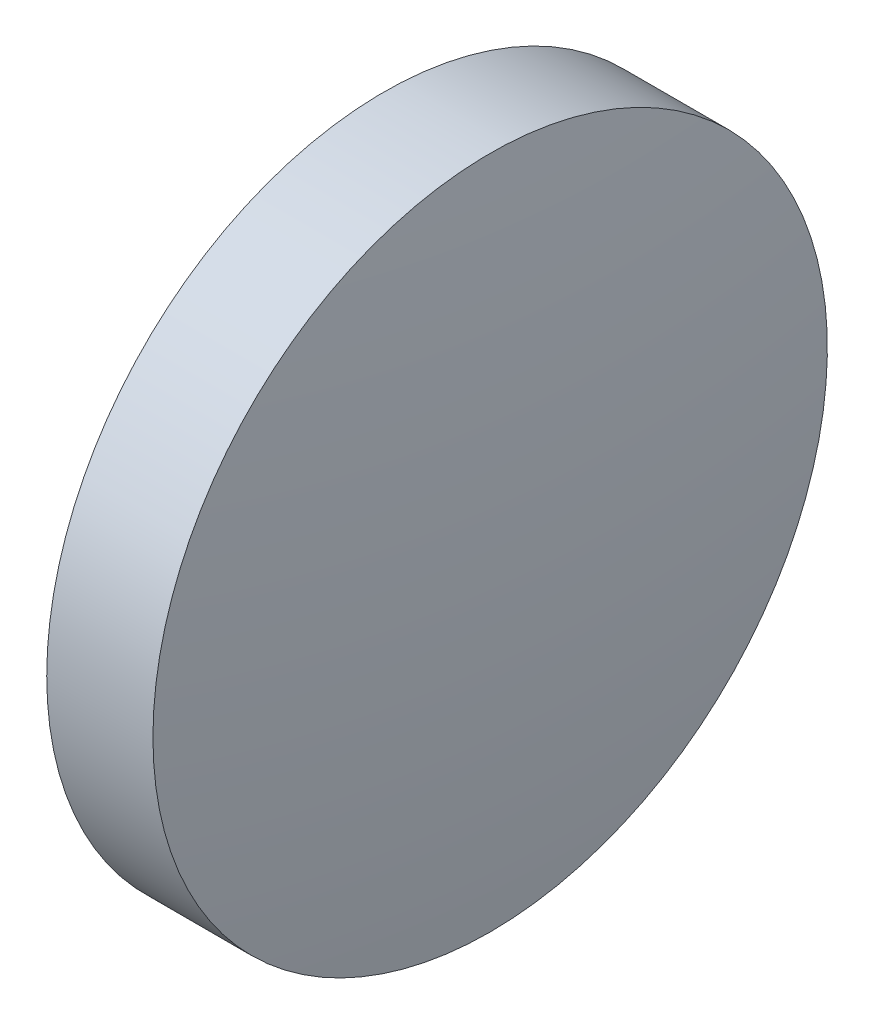
ISO-10303-21;
HEADER;
FILE_DESCRIPTION(('STEP AP214'),'2;1');
FILE_NAME('part.step','',(''),(''),'','','');
FILE_SCHEMA(('AUTOMOTIVE_DESIGN { 1 0 10303 214 1 1 1 1 }'));
ENDSEC;
DATA;
#1=APPLICATION_CONTEXT('core data for automotive mechanical design processes');
#2=APPLICATION_PROTOCOL_DEFINITION('international standard','automotive_design',2000,#1);
#3=PRODUCT_CONTEXT('',#1,'mechanical');
#4=PRODUCT('Part','Part','',(#3));
#5=PRODUCT_RELATED_PRODUCT_CATEGORY('part','',(#4));
#6=PRODUCT_DEFINITION_FORMATION('','',#4);
#7=PRODUCT_DEFINITION_CONTEXT('part definition',#1,'design');
#8=PRODUCT_DEFINITION('design','',#6,#7);
#9=PRODUCT_DEFINITION_SHAPE('','',#8);
#10=(LENGTH_UNIT() NAMED_UNIT(*) SI_UNIT(.MILLI.,.METRE.));
#11=(NAMED_UNIT(*) PLANE_ANGLE_UNIT() SI_UNIT($,.RADIAN.));
#12=(NAMED_UNIT(*) SI_UNIT($,.STERADIAN.) SOLID_ANGLE_UNIT());
#13=UNCERTAINTY_MEASURE_WITH_UNIT(LENGTH_MEASURE(1.E-05),#10,'distance_accuracy_value','');
#14=(GEOMETRIC_REPRESENTATION_CONTEXT(3) GLOBAL_UNCERTAINTY_ASSIGNED_CONTEXT((#13)) GLOBAL_UNIT_ASSIGNED_CONTEXT((#10,
#11,#12)) REPRESENTATION_CONTEXT('',''));
#15=CARTESIAN_POINT('',(0.,0.,0.));
#16=DIRECTION('',(0.,0.,1.));
#17=DIRECTION('',(1.,0.,0.));
#18=AXIS2_PLACEMENT_3D('',#15,#16,#17);
#19=CARTESIAN_POINT('',(503.609445364495,54.8274799908201,0.));
#20=DIRECTION('',(-1.,0.,0.));
#21=DIRECTION('',(0.,-1.,0.));
#22=AXIS2_PLACEMENT_3D('',#19,#20,#21);
#23=SPHERICAL_SURFACE('',#22,50.6031249999999);
#24=CARTESIAN_POINT('',(553.812570364495,54.82747999082,0.));
#25=DIRECTION('',(-1.,0.,0.));
#26=DIRECTION('',(0.,0.,1.));
#27=AXIS2_PLACEMENT_3D('',#24,#25,#26);
#28=CIRCLE('',#27,6.35);
#29=CARTESIAN_POINT('',(553.812570364495,54.82747999082,6.35));
#30=VERTEX_POINT('',#29);
#31=EDGE_CURVE('E10',#30,#30,#28,.T.);
#32=ORIENTED_EDGE('',*,*,#31,.F.);
#33=EDGE_LOOP('',(#32));
#34=FACE_BOUND('',#33,.T.);
#35=ADVANCED_FACE('F35',(#34),#23,.T.);
#36=CARTESIAN_POINT('',(549.55203921864,54.82747999082,0.));
#37=DIRECTION('',(-1.,0.,0.));
#38=DIRECTION('',(0.,0.,1.));
#39=AXIS2_PLACEMENT_3D('',#36,#37,#38);
#40=CYLINDRICAL_SURFACE('',#39,6.35);
#41=CARTESIAN_POINT('',(551.812570364495,54.82747999082,0.));
#42=DIRECTION('',(-1.,0.,0.));
#43=DIRECTION('',(0.,0.,1.));
#44=AXIS2_PLACEMENT_3D('',#41,#42,#43);
#45=CIRCLE('',#44,6.35);
#46=CARTESIAN_POINT('',(551.812570364495,54.82747999082,6.35));
#47=VERTEX_POINT('',#46);
#48=EDGE_CURVE('E41',#47,#47,#45,.T.);
#49=ORIENTED_EDGE('',*,*,#48,.F.);
#50=EDGE_LOOP('',(#49));
#51=FACE_BOUND('',#50,.T.);
#52=ORIENTED_EDGE('',*,*,#31,.T.);
#53=EDGE_LOOP('',(#52));
#54=FACE_BOUND('',#53,.T.);
#55=ADVANCED_FACE('F49',(#51,#54),#40,.T.);
#56=CARTESIAN_POINT('',(551.812570364495,54.82747999082,0.));
#57=DIRECTION('',(1.,0.,0.));
#58=DIRECTION('',(0.,0.,-1.));
#59=AXIS2_PLACEMENT_3D('',#56,#57,#58);
#60=PLANE('',#59);
#61=ORIENTED_EDGE('',*,*,#48,.T.);
#62=EDGE_LOOP('',(#61));
#63=FACE_BOUND('',#62,.T.);
#64=ADVANCED_FACE('F47',(#63),#60,.F.);
#65=CLOSED_SHELL('',(#35,#55,#64));
#66=MANIFOLD_SOLID_BREP('B2',#65);
#67=ADVANCED_BREP_SHAPE_REPRESENTATION('',(#18,#66),#14);
#68=SHAPE_DEFINITION_REPRESENTATION(#9,#67);
ENDSEC;
END-ISO-10303-21;
